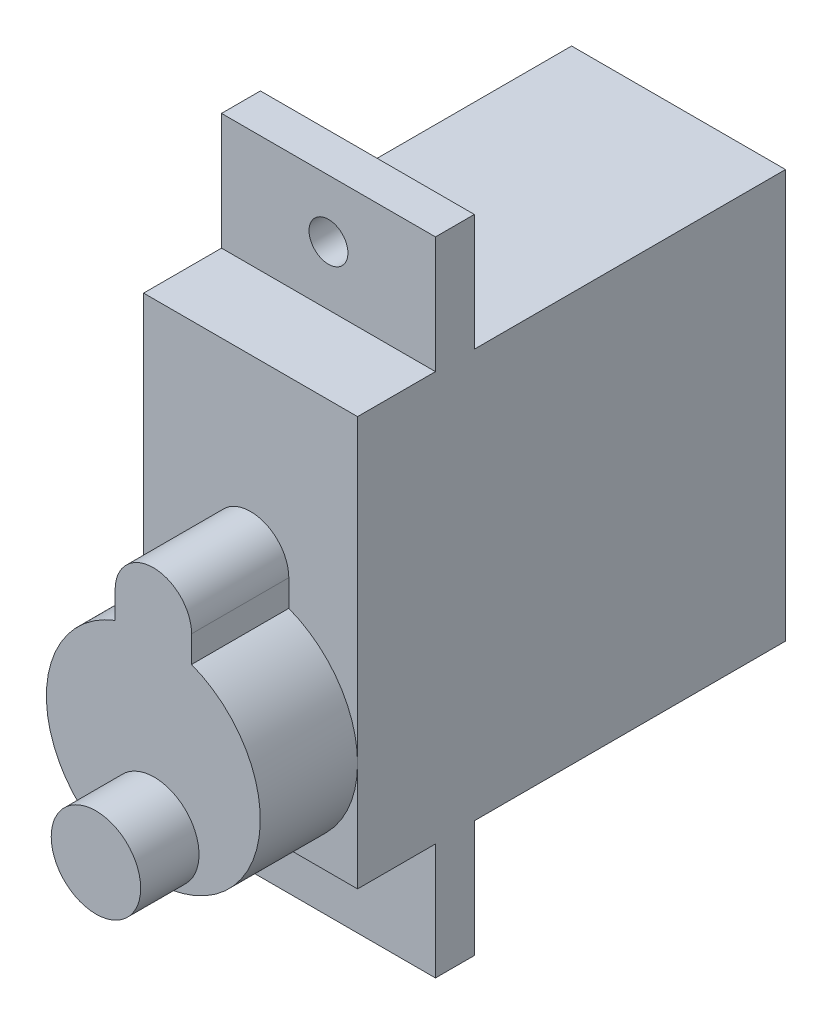
ISO-10303-21;
HEADER;
FILE_DESCRIPTION(('STEP AP214'),'2;1');
FILE_NAME('part.step','',(''),(''),'','','');
FILE_SCHEMA(('AUTOMOTIVE_DESIGN { 1 0 10303 214 1 1 1 1 }'));
ENDSEC;
DATA;
#1=APPLICATION_CONTEXT('core data for automotive mechanical design processes');
#2=APPLICATION_PROTOCOL_DEFINITION('international standard','automotive_design',2000,#1);
#3=PRODUCT_CONTEXT('',#1,'mechanical');
#4=PRODUCT('Part','Part','',(#3));
#5=PRODUCT_RELATED_PRODUCT_CATEGORY('part','',(#4));
#6=PRODUCT_DEFINITION_FORMATION('','',#4);
#7=PRODUCT_DEFINITION_CONTEXT('part definition',#1,'design');
#8=PRODUCT_DEFINITION('design','',#6,#7);
#9=PRODUCT_DEFINITION_SHAPE('','',#8);
#10=(LENGTH_UNIT() NAMED_UNIT(*) SI_UNIT(.MILLI.,.METRE.));
#11=(NAMED_UNIT(*) PLANE_ANGLE_UNIT() SI_UNIT($,.RADIAN.));
#12=(NAMED_UNIT(*) SI_UNIT($,.STERADIAN.) SOLID_ANGLE_UNIT());
#13=UNCERTAINTY_MEASURE_WITH_UNIT(LENGTH_MEASURE(1.E-05),#10,'distance_accuracy_value','');
#14=(GEOMETRIC_REPRESENTATION_CONTEXT(3) GLOBAL_UNCERTAINTY_ASSIGNED_CONTEXT((#13)) GLOBAL_UNIT_ASSIGNED_CONTEXT((#10,
#11,#12)) REPRESENTATION_CONTEXT('',''));
#15=CARTESIAN_POINT('',(0.,0.,0.));
#16=DIRECTION('',(0.,0.,1.));
#17=DIRECTION('',(1.,0.,0.));
#18=AXIS2_PLACEMENT_3D('',#15,#16,#17);
#19=CARTESIAN_POINT('',(-5.50100000000001,0.,23.0050610786414));
#20=DIRECTION('',(0.,0.,1.));
#21=DIRECTION('',(1.,0.,0.));
#22=AXIS2_PLACEMENT_3D('',#19,#20,#21);
#23=PLANE('',#22);
#24=CARTESIAN_POINT('',(0.,-4.94231580718279,23.0050610786414));
#25=DIRECTION('',(0.,0.,1.));
#26=DIRECTION('',(1.,0.,0.));
#27=AXIS2_PLACEMENT_3D('',#24,#25,#26);
#28=CIRCLE('',#27,5.5);
#29=CARTESIAN_POINT('',(5.5,-4.94231580718279,23.0050610786414));
#30=VERTEX_POINT('',#29);
#31=CARTESIAN_POINT('',(1.96459324859384,0.194840348471761,23.0050610786414));
#32=VERTEX_POINT('',#31);
#33=EDGE_CURVE('E210',#30,#32,#28,.T.);
#34=ORIENTED_EDGE('',*,*,#33,.F.);
#35=DIRECTION('',(0.,-1.,0.));
#36=VECTOR('',#35,1.);
#37=CARTESIAN_POINT('',(5.5,0.,23.0050610786414));
#38=LINE('',#37,#36);
#39=CARTESIAN_POINT('',(5.5,10.5,23.0050610786414));
#40=VERTEX_POINT('',#39);
#41=EDGE_CURVE('E287',#40,#30,#38,.T.);
#42=ORIENTED_EDGE('',*,*,#41,.F.);
#43=DIRECTION('',(1.,0.,0.));
#44=VECTOR('',#43,1.);
#45=CARTESIAN_POINT('',(-5.50100000000001,10.5,23.0050610786414));
#46=LINE('',#45,#44);
#47=CARTESIAN_POINT('',(-5.5,10.5,23.0050610786414));
#48=VERTEX_POINT('',#47);
#49=EDGE_CURVE('E276',#48,#40,#46,.T.);
#50=ORIENTED_EDGE('',*,*,#49,.F.);
#51=DIRECTION('',(0.,1.,0.));
#52=VECTOR('',#51,1.);
#53=CARTESIAN_POINT('',(-5.5,0.,23.0050610786414));
#54=LINE('',#53,#52);
#55=CARTESIAN_POINT('',(-5.5,-4.9423158071828,23.0050610786414));
#56=VERTEX_POINT('',#55);
#57=EDGE_CURVE('E306',#56,#48,#54,.T.);
#58=ORIENTED_EDGE('',*,*,#57,.F.);
#59=CARTESIAN_POINT('',(-1.96459324859384,0.19484034847176,23.0050610786414));
#60=VERTEX_POINT('',#59);
#61=EDGE_CURVE('E214',#60,#56,#28,.T.);
#62=ORIENTED_EDGE('',*,*,#61,.F.);
#63=DIRECTION('',(0.,-1.,0.));
#64=VECTOR('',#63,1.);
#65=CARTESIAN_POINT('',(-1.96459324859384,1.55992255651431,23.0050610786414));
#66=LINE('',#65,#64);
#67=CARTESIAN_POINT('',(-1.96459324859384,1.55992255651431,23.0050610786414));
#68=VERTEX_POINT('',#67);
#69=EDGE_CURVE('E222',#68,#60,#66,.T.);
#70=ORIENTED_EDGE('',*,*,#69,.F.);
#71=CARTESIAN_POINT('',(0.,1.55992255651431,23.0050610786414));
#72=DIRECTION('',(0.,0.,1.));
#73=DIRECTION('',(-1.,0.,0.));
#74=AXIS2_PLACEMENT_3D('',#71,#72,#73);
#75=CIRCLE('',#74,1.96459324859384);
#76=CARTESIAN_POINT('',(1.96459324859384,1.55992255651431,23.0050610786414));
#77=VERTEX_POINT('',#76);
#78=EDGE_CURVE('E226',#77,#68,#75,.T.);
#79=ORIENTED_EDGE('',*,*,#78,.F.);
#80=DIRECTION('',(0.,1.,0.));
#81=VECTOR('',#80,1.);
#82=CARTESIAN_POINT('',(1.96459324859384,1.55992255651431,23.0050610786414));
#83=LINE('',#82,#81);
#84=EDGE_CURVE('E58',#32,#77,#83,.T.);
#85=ORIENTED_EDGE('',*,*,#84,.F.);
#86=EDGE_LOOP('',(#34,#42,#50,#58,#62,#70,#79,#85));
#87=FACE_BOUND('',#86,.T.);
#88=ADVANCED_FACE('F36',(#87),#23,.T.);
#89=CARTESIAN_POINT('',(5.5,16.5,33.));
#90=DIRECTION('',(-1.,0.,0.));
#91=DIRECTION('',(0.,-1.,0.));
#92=AXIS2_PLACEMENT_3D('',#89,#90,#91);
#93=PLANE('',#92);
#94=DIRECTION('',(0.,0.,1.));
#95=VECTOR('',#94,1.);
#96=CARTESIAN_POINT('',(5.5,-10.5,17.));
#97=LINE('',#96,#95);
#98=CARTESIAN_POINT('',(5.5,-10.5,1.));
#99=VERTEX_POINT('',#98);
#100=CARTESIAN_POINT('',(5.5,-10.5,17.));
#101=VERTEX_POINT('',#100);
#102=EDGE_CURVE('E165',#99,#101,#97,.T.);
#103=ORIENTED_EDGE('',*,*,#102,.F.);
#104=DIRECTION('',(0.,-1.,0.));
#105=VECTOR('',#104,1.);
#106=CARTESIAN_POINT('',(5.5,-10.5,1.));
#107=LINE('',#106,#105);
#108=CARTESIAN_POINT('',(5.5,10.5,1.));
#109=VERTEX_POINT('',#108);
#110=EDGE_CURVE('E153',#109,#99,#107,.T.);
#111=ORIENTED_EDGE('',*,*,#110,.F.);
#112=DIRECTION('',(0.,0.,1.));
#113=VECTOR('',#112,1.);
#114=CARTESIAN_POINT('',(5.5,10.5,17.));
#115=LINE('',#114,#113);
#116=CARTESIAN_POINT('',(5.5,10.5,17.));
#117=VERTEX_POINT('',#116);
#118=EDGE_CURVE('E162',#109,#117,#115,.T.);
#119=ORIENTED_EDGE('',*,*,#118,.T.);
#120=DIRECTION('',(0.,1.,0.));
#121=VECTOR('',#120,1.);
#122=CARTESIAN_POINT('',(5.5,10.5,17.));
#123=LINE('',#122,#121);
#124=CARTESIAN_POINT('',(5.5,16.5,17.));
#125=VERTEX_POINT('',#124);
#126=EDGE_CURVE('E174',#117,#125,#123,.T.);
#127=ORIENTED_EDGE('',*,*,#126,.T.);
#128=DIRECTION('',(0.,0.,-1.));
#129=VECTOR('',#128,1.);
#130=CARTESIAN_POINT('',(5.5,16.5,33.));
#131=LINE('',#130,#129);
#132=CARTESIAN_POINT('',(5.5,16.5,19.));
#133=VERTEX_POINT('',#132);
#134=EDGE_CURVE('E207',#133,#125,#131,.T.);
#135=ORIENTED_EDGE('',*,*,#134,.F.);
#136=DIRECTION('',(0.,-1.,0.));
#137=VECTOR('',#136,1.);
#138=CARTESIAN_POINT('',(5.5,0.,19.));
#139=LINE('',#138,#137);
#140=CARTESIAN_POINT('',(5.5,10.5,19.));
#141=VERTEX_POINT('',#140);
#142=EDGE_CURVE('E271',#133,#141,#139,.T.);
#143=ORIENTED_EDGE('',*,*,#142,.T.);
#144=DIRECTION('',(0.,0.,1.));
#145=VECTOR('',#144,1.);
#146=CARTESIAN_POINT('',(5.5,10.5,0.));
#147=LINE('',#146,#145);
#148=EDGE_CURVE('E284',#141,#40,#147,.T.);
#149=ORIENTED_EDGE('',*,*,#148,.T.);
#150=ORIENTED_EDGE('',*,*,#41,.T.);
#151=CARTESIAN_POINT('',(5.5,-10.5309205573809,23.0050610786414));
#152=VERTEX_POINT('',#151);
#153=EDGE_CURVE('E290',#30,#152,#38,.T.);
#154=ORIENTED_EDGE('',*,*,#153,.T.);
#155=DIRECTION('',(0.,0.,1.));
#156=VECTOR('',#155,1.);
#157=CARTESIAN_POINT('',(5.5,-10.5309205573809,0.));
#158=LINE('',#157,#156);
#159=CARTESIAN_POINT('',(5.5,-10.5309205573809,19.));
#160=VERTEX_POINT('',#159);
#161=EDGE_CURVE('E291',#160,#152,#158,.T.);
#162=ORIENTED_EDGE('',*,*,#161,.F.);
#163=DIRECTION('',(0.,1.,0.));
#164=VECTOR('',#163,1.);
#165=CARTESIAN_POINT('',(5.5,0.,19.));
#166=LINE('',#165,#164);
#167=CARTESIAN_POINT('',(5.5,-16.5,19.));
#168=VERTEX_POINT('',#167);
#169=EDGE_CURVE('E294',#168,#160,#166,.T.);
#170=ORIENTED_EDGE('',*,*,#169,.F.);
#171=DIRECTION('',(0.,0.,-1.));
#172=VECTOR('',#171,1.);
#173=CARTESIAN_POINT('',(5.5,-16.5,33.));
#174=LINE('',#173,#172);
#175=CARTESIAN_POINT('',(5.5,-16.5,17.));
#176=VERTEX_POINT('',#175);
#177=EDGE_CURVE('E199',#168,#176,#174,.T.);
#178=ORIENTED_EDGE('',*,*,#177,.T.);
#179=DIRECTION('',(0.,-1.,0.));
#180=VECTOR('',#179,1.);
#181=CARTESIAN_POINT('',(5.5,-10.5,17.));
#182=LINE('',#181,#180);
#183=EDGE_CURVE('E193',#101,#176,#182,.T.);
#184=ORIENTED_EDGE('',*,*,#183,.F.);
#185=EDGE_LOOP('',(#103,#111,#119,#127,#135,#143,#149,#150,#154,#162,#170,#178,#184));
#186=FACE_BOUND('',#185,.T.);
#187=ADVANCED_FACE('F38',(#186),#93,.F.);
#188=CARTESIAN_POINT('',(-5.5,16.5,33.));
#189=DIRECTION('',(0.,-1.,0.));
#190=DIRECTION('',(0.,0.,-1.));
#191=AXIS2_PLACEMENT_3D('',#188,#189,#190);
#192=PLANE('',#191);
#193=DIRECTION('',(1.,0.,0.));
#194=VECTOR('',#193,1.);
#195=CARTESIAN_POINT('',(-5.50100000000001,16.5,19.));
#196=LINE('',#195,#194);
#197=CARTESIAN_POINT('',(-5.5,16.5,19.));
#198=VERTEX_POINT('',#197);
#199=EDGE_CURVE('E267',#198,#133,#196,.T.);
#200=ORIENTED_EDGE('',*,*,#199,.T.);
#201=ORIENTED_EDGE('',*,*,#134,.T.);
#202=DIRECTION('',(-1.,0.,0.));
#203=VECTOR('',#202,1.);
#204=CARTESIAN_POINT('',(-5.5,16.5,17.));
#205=LINE('',#204,#203);
#206=CARTESIAN_POINT('',(-5.5,16.5,17.));
#207=VERTEX_POINT('',#206);
#208=EDGE_CURVE('E180',#125,#207,#205,.T.);
#209=ORIENTED_EDGE('',*,*,#208,.T.);
#210=DIRECTION('',(0.,0.,-1.));
#211=VECTOR('',#210,1.);
#212=CARTESIAN_POINT('',(-5.5,16.5,33.));
#213=LINE('',#212,#211);
#214=EDGE_CURVE('E205',#198,#207,#213,.T.);
#215=ORIENTED_EDGE('',*,*,#214,.F.);
#216=EDGE_LOOP('',(#200,#201,#209,#215));
#217=FACE_BOUND('',#216,.T.);
#218=ADVANCED_FACE('F345',(#217),#192,.F.);
#219=CARTESIAN_POINT('',(-5.5,16.5,33.));
#220=DIRECTION('',(1.,0.,0.));
#221=DIRECTION('',(0.,1.,0.));
#222=AXIS2_PLACEMENT_3D('',#219,#220,#221);
#223=PLANE('',#222);
#224=DIRECTION('',(0.,0.,-1.));
#225=VECTOR('',#224,1.);
#226=CARTESIAN_POINT('',(-5.5,10.5,17.));
#227=LINE('',#226,#225);
#228=CARTESIAN_POINT('',(-5.5,10.5,17.));
#229=VERTEX_POINT('',#228);
#230=CARTESIAN_POINT('',(-5.5,10.5,1.));
#231=VERTEX_POINT('',#230);
#232=EDGE_CURVE('E176',#229,#231,#227,.T.);
#233=ORIENTED_EDGE('',*,*,#232,.T.);
#234=DIRECTION('',(0.,-1.,0.));
#235=VECTOR('',#234,1.);
#236=CARTESIAN_POINT('',(-5.5,16.5,1.));
#237=LINE('',#236,#235);
#238=CARTESIAN_POINT('',(-5.5,-10.5,1.));
#239=VERTEX_POINT('',#238);
#240=EDGE_CURVE('E51',#231,#239,#237,.T.);
#241=ORIENTED_EDGE('',*,*,#240,.T.);
#242=DIRECTION('',(0.,0.,-1.));
#243=VECTOR('',#242,1.);
#244=CARTESIAN_POINT('',(-5.5,-10.5,17.));
#245=LINE('',#244,#243);
#246=CARTESIAN_POINT('',(-5.5,-10.5,17.));
#247=VERTEX_POINT('',#246);
#248=EDGE_CURVE('E186',#247,#239,#245,.T.);
#249=ORIENTED_EDGE('',*,*,#248,.F.);
#250=DIRECTION('',(0.,-1.,0.));
#251=VECTOR('',#250,1.);
#252=CARTESIAN_POINT('',(-5.5,-10.5,17.));
#253=LINE('',#252,#251);
#254=CARTESIAN_POINT('',(-5.5,-16.5,17.));
#255=VERTEX_POINT('',#254);
#256=EDGE_CURVE('E196',#247,#255,#253,.T.);
#257=ORIENTED_EDGE('',*,*,#256,.T.);
#258=DIRECTION('',(0.,0.,-1.));
#259=VECTOR('',#258,1.);
#260=CARTESIAN_POINT('',(-5.5,-16.5,33.));
#261=LINE('',#260,#259);
#262=CARTESIAN_POINT('',(-5.5,-16.5,19.));
#263=VERTEX_POINT('',#262);
#264=EDGE_CURVE('E203',#263,#255,#261,.T.);
#265=ORIENTED_EDGE('',*,*,#264,.F.);
#266=DIRECTION('',(0.,-1.,0.));
#267=VECTOR('',#266,1.);
#268=CARTESIAN_POINT('',(-5.5,0.,19.));
#269=LINE('',#268,#267);
#270=CARTESIAN_POINT('',(-5.5,-10.5309205573809,19.));
#271=VERTEX_POINT('',#270);
#272=EDGE_CURVE('E183',#271,#263,#269,.T.);
#273=ORIENTED_EDGE('',*,*,#272,.F.);
#274=DIRECTION('',(0.,0.,-1.));
#275=VECTOR('',#274,1.);
#276=CARTESIAN_POINT('',(-5.5,-10.5309205573809,0.));
#277=LINE('',#276,#275);
#278=CARTESIAN_POINT('',(-5.5,-10.5309205573809,23.0050610786414));
#279=VERTEX_POINT('',#278);
#280=EDGE_CURVE('E307',#279,#271,#277,.T.);
#281=ORIENTED_EDGE('',*,*,#280,.F.);
#282=EDGE_CURVE('E303',#279,#56,#54,.T.);
#283=ORIENTED_EDGE('',*,*,#282,.T.);
#284=ORIENTED_EDGE('',*,*,#57,.T.);
#285=DIRECTION('',(0.,0.,-1.));
#286=VECTOR('',#285,1.);
#287=CARTESIAN_POINT('',(-5.5,10.5,0.));
#288=LINE('',#287,#286);
#289=CARTESIAN_POINT('',(-5.5,10.5,19.));
#290=VERTEX_POINT('',#289);
#291=EDGE_CURVE('E300',#48,#290,#288,.T.);
#292=ORIENTED_EDGE('',*,*,#291,.T.);
#293=DIRECTION('',(0.,1.,0.));
#294=VECTOR('',#293,1.);
#295=CARTESIAN_POINT('',(-5.5,0.,19.));
#296=LINE('',#295,#294);
#297=EDGE_CURVE('E297',#290,#198,#296,.T.);
#298=ORIENTED_EDGE('',*,*,#297,.T.);
#299=ORIENTED_EDGE('',*,*,#214,.T.);
#300=DIRECTION('',(0.,1.,0.));
#301=VECTOR('',#300,1.);
#302=CARTESIAN_POINT('',(-5.5,10.5,17.));
#303=LINE('',#302,#301);
#304=EDGE_CURVE('E171',#229,#207,#303,.T.);
#305=ORIENTED_EDGE('',*,*,#304,.F.);
#306=EDGE_LOOP('',(#233,#241,#249,#257,#265,#273,#281,#283,#284,#292,#298,#299,#305));
#307=FACE_BOUND('',#306,.T.);
#308=ADVANCED_FACE('F263',(#307),#223,.F.);
#309=CARTESIAN_POINT('',(-5.5,-16.5,33.));
#310=DIRECTION('',(0.,1.,0.));
#311=DIRECTION('',(0.,0.,1.));
#312=AXIS2_PLACEMENT_3D('',#309,#310,#311);
#313=PLANE('',#312);
#314=ORIENTED_EDGE('',*,*,#177,.F.);
#315=DIRECTION('',(1.,0.,0.));
#316=VECTOR('',#315,1.);
#317=CARTESIAN_POINT('',(-5.501,-16.5,19.));
#318=LINE('',#317,#316);
#319=EDGE_CURVE('E268',#263,#168,#318,.T.);
#320=ORIENTED_EDGE('',*,*,#319,.F.);
#321=ORIENTED_EDGE('',*,*,#264,.T.);
#322=DIRECTION('',(-1.,0.,0.));
#323=VECTOR('',#322,1.);
#324=CARTESIAN_POINT('',(-5.5,-16.5,17.));
#325=LINE('',#324,#323);
#326=EDGE_CURVE('E184',#176,#255,#325,.T.);
#327=ORIENTED_EDGE('',*,*,#326,.F.);
#328=EDGE_LOOP('',(#314,#320,#321,#327));
#329=FACE_BOUND('',#328,.T.);
#330=ADVANCED_FACE('F395',(#329),#313,.F.);
#331=CARTESIAN_POINT('',(-5.5,-10.5,17.));
#332=DIRECTION('',(0.,0.,1.));
#333=DIRECTION('',(1.,0.,0.));
#334=AXIS2_PLACEMENT_3D('',#331,#332,#333);
#335=PLANE('',#334);
#336=CARTESIAN_POINT('',(0.,-13.5309205573809,17.));
#337=DIRECTION('',(0.,0.,1.));
#338=DIRECTION('',(1.,0.,0.));
#339=AXIS2_PLACEMENT_3D('',#336,#337,#338);
#340=CIRCLE('',#339,1.);
#341=CARTESIAN_POINT('',(1.,-13.5309205573809,17.));
#342=VERTEX_POINT('',#341);
#343=EDGE_CURVE('E248',#342,#342,#340,.T.);
#344=ORIENTED_EDGE('',*,*,#343,.T.);
#345=EDGE_LOOP('',(#344));
#346=FACE_BOUND('',#345,.T.);
#347=ORIENTED_EDGE('',*,*,#326,.T.);
#348=ORIENTED_EDGE('',*,*,#256,.F.);
#349=DIRECTION('',(-1.,0.,0.));
#350=VECTOR('',#349,1.);
#351=CARTESIAN_POINT('',(-5.5,-10.5,17.));
#352=LINE('',#351,#350);
#353=EDGE_CURVE('E190',#101,#247,#352,.T.);
#354=ORIENTED_EDGE('',*,*,#353,.F.);
#355=ORIENTED_EDGE('',*,*,#183,.T.);
#356=EDGE_LOOP('',(#347,#348,#354,#355));
#357=FACE_BOUND('',#356,.T.);
#358=ADVANCED_FACE('F388',(#346,#357),#335,.F.);
#359=CARTESIAN_POINT('',(0.,-10.5,0.));
#360=DIRECTION('',(0.,1.,0.));
#361=DIRECTION('',(0.,0.,1.));
#362=AXIS2_PLACEMENT_3D('',#359,#360,#361);
#363=PLANE('',#362);
#364=ORIENTED_EDGE('',*,*,#248,.T.);
#365=DIRECTION('',(1.,0.,0.));
#366=VECTOR('',#365,1.);
#367=CARTESIAN_POINT('',(-14.5,-10.5,1.));
#368=LINE('',#367,#366);
#369=EDGE_CURVE('E166',#239,#99,#368,.T.);
#370=ORIENTED_EDGE('',*,*,#369,.T.);
#371=ORIENTED_EDGE('',*,*,#102,.T.);
#372=ORIENTED_EDGE('',*,*,#353,.T.);
#373=EDGE_LOOP('',(#364,#370,#371,#372));
#374=FACE_BOUND('',#373,.T.);
#375=ADVANCED_FACE('F259',(#374),#363,.F.);
#376=CARTESIAN_POINT('',(-5.5,10.5,17.));
#377=DIRECTION('',(0.,0.,-1.));
#378=DIRECTION('',(-1.,0.,0.));
#379=AXIS2_PLACEMENT_3D('',#376,#377,#378);
#380=PLANE('',#379);
#381=CARTESIAN_POINT('',(0.,13.5309205573809,17.));
#382=DIRECTION('',(0.,0.,-1.));
#383=DIRECTION('',(-1.,0.,0.));
#384=AXIS2_PLACEMENT_3D('',#381,#382,#383);
#385=CIRCLE('',#384,1.);
#386=CARTESIAN_POINT('',(-1.,13.5309205573809,17.));
#387=VERTEX_POINT('',#386);
#388=EDGE_CURVE('E245',#387,#387,#385,.T.);
#389=ORIENTED_EDGE('',*,*,#388,.F.);
#390=EDGE_LOOP('',(#389));
#391=FACE_BOUND('',#390,.T.);
#392=ORIENTED_EDGE('',*,*,#208,.F.);
#393=ORIENTED_EDGE('',*,*,#126,.F.);
#394=DIRECTION('',(-1.,0.,0.));
#395=VECTOR('',#394,1.);
#396=CARTESIAN_POINT('',(-5.5,10.5,17.));
#397=LINE('',#396,#395);
#398=EDGE_CURVE('E170',#117,#229,#397,.T.);
#399=ORIENTED_EDGE('',*,*,#398,.T.);
#400=ORIENTED_EDGE('',*,*,#304,.T.);
#401=EDGE_LOOP('',(#392,#393,#399,#400));
#402=FACE_BOUND('',#401,.T.);
#403=ADVANCED_FACE('F379',(#391,#402),#380,.T.);
#404=CARTESIAN_POINT('',(0.,10.5,0.));
#405=DIRECTION('',(0.,-1.,0.));
#406=DIRECTION('',(0.,0.,1.));
#407=AXIS2_PLACEMENT_3D('',#404,#405,#406);
#408=PLANE('',#407);
#409=ORIENTED_EDGE('',*,*,#118,.F.);
#410=DIRECTION('',(-1.,0.,0.));
#411=VECTOR('',#410,1.);
#412=CARTESIAN_POINT('',(0.,10.5,1.));
#413=LINE('',#412,#411);
#414=EDGE_CURVE('E11',#109,#231,#413,.T.);
#415=ORIENTED_EDGE('',*,*,#414,.T.);
#416=ORIENTED_EDGE('',*,*,#232,.F.);
#417=ORIENTED_EDGE('',*,*,#398,.F.);
#418=EDGE_LOOP('',(#409,#415,#416,#417));
#419=FACE_BOUND('',#418,.T.);
#420=ADVANCED_FACE('F169',(#419),#408,.F.);
#421=CARTESIAN_POINT('',(-5.50100000000001,0.,19.));
#422=DIRECTION('',(0.,0.,1.));
#423=DIRECTION('',(0.,-1.,0.));
#424=AXIS2_PLACEMENT_3D('',#421,#422,#423);
#425=PLANE('',#424);
#426=CARTESIAN_POINT('',(0.,13.5309205573809,19.));
#427=DIRECTION('',(0.,0.,1.));
#428=DIRECTION('',(-1.,0.,0.));
#429=AXIS2_PLACEMENT_3D('',#426,#427,#428);
#430=CIRCLE('',#429,1.);
#431=CARTESIAN_POINT('',(-1.,13.5309205573809,19.));
#432=VERTEX_POINT('',#431);
#433=EDGE_CURVE('E252',#432,#432,#430,.T.);
#434=ORIENTED_EDGE('',*,*,#433,.F.);
#435=EDGE_LOOP('',(#434));
#436=FACE_BOUND('',#435,.T.);
#437=DIRECTION('',(1.,0.,0.));
#438=VECTOR('',#437,1.);
#439=CARTESIAN_POINT('',(-5.50100000000001,10.5,19.));
#440=LINE('',#439,#438);
#441=EDGE_CURVE('E278',#290,#141,#440,.T.);
#442=ORIENTED_EDGE('',*,*,#441,.T.);
#443=ORIENTED_EDGE('',*,*,#142,.F.);
#444=ORIENTED_EDGE('',*,*,#199,.F.);
#445=ORIENTED_EDGE('',*,*,#297,.F.);
#446=EDGE_LOOP('',(#442,#443,#444,#445));
#447=FACE_BOUND('',#446,.T.);
#448=ADVANCED_FACE('F357',(#436,#447),#425,.T.);
#449=CARTESIAN_POINT('',(-5.50100000000001,10.5,0.));
#450=DIRECTION('',(0.,1.,0.));
#451=DIRECTION('',(-1.,0.,0.));
#452=AXIS2_PLACEMENT_3D('',#449,#450,#451);
#453=PLANE('',#452);
#454=ORIENTED_EDGE('',*,*,#49,.T.);
#455=ORIENTED_EDGE('',*,*,#148,.F.);
#456=ORIENTED_EDGE('',*,*,#441,.F.);
#457=ORIENTED_EDGE('',*,*,#291,.F.);
#458=EDGE_LOOP('',(#454,#455,#456,#457));
#459=FACE_BOUND('',#458,.T.);
#460=ADVANCED_FACE('F350',(#459),#453,.T.);
#461=EDGE_CURVE('E208',#56,#30,#28,.T.);
#462=ORIENTED_EDGE('',*,*,#461,.F.);
#463=ORIENTED_EDGE('',*,*,#282,.F.);
#464=DIRECTION('',(1.,0.,0.));
#465=VECTOR('',#464,1.);
#466=CARTESIAN_POINT('',(-5.501,-10.5309205573809,23.0050610786414));
#467=LINE('',#466,#465);
#468=EDGE_CURVE('E273',#279,#152,#467,.T.);
#469=ORIENTED_EDGE('',*,*,#468,.T.);
#470=ORIENTED_EDGE('',*,*,#153,.F.);
#471=EDGE_LOOP('',(#462,#463,#469,#470));
#472=FACE_BOUND('',#471,.T.);
#473=ADVANCED_FACE('F341',(#472),#23,.T.);
#474=CARTESIAN_POINT('',(-5.501,-10.5309205573809,0.));
#475=DIRECTION('',(0.,1.,0.));
#476=DIRECTION('',(-1.,0.,0.));
#477=AXIS2_PLACEMENT_3D('',#474,#475,#476);
#478=PLANE('',#477);
#479=ORIENTED_EDGE('',*,*,#280,.T.);
#480=DIRECTION('',(1.,0.,0.));
#481=VECTOR('',#480,1.);
#482=CARTESIAN_POINT('',(-5.501,-10.5309205573809,19.));
#483=LINE('',#482,#481);
#484=EDGE_CURVE('E270',#271,#160,#483,.T.);
#485=ORIENTED_EDGE('',*,*,#484,.T.);
#486=ORIENTED_EDGE('',*,*,#161,.T.);
#487=ORIENTED_EDGE('',*,*,#468,.F.);
#488=EDGE_LOOP('',(#479,#485,#486,#487));
#489=FACE_BOUND('',#488,.T.);
#490=ADVANCED_FACE('F349',(#489),#478,.F.);
#491=CARTESIAN_POINT('',(-5.50100000000001,0.,19.));
#492=DIRECTION('',(0.,0.,-1.));
#493=DIRECTION('',(-1.,0.,0.));
#494=AXIS2_PLACEMENT_3D('',#491,#492,#493);
#495=PLANE('',#494);
#496=CARTESIAN_POINT('',(0.,-13.5309205573809,19.));
#497=DIRECTION('',(0.,0.,1.));
#498=DIRECTION('',(1.,0.,0.));
#499=AXIS2_PLACEMENT_3D('',#496,#497,#498);
#500=CIRCLE('',#499,1.);
#501=CARTESIAN_POINT('',(1.,-13.5309205573809,19.));
#502=VERTEX_POINT('',#501);
#503=EDGE_CURVE('E251',#502,#502,#500,.T.);
#504=ORIENTED_EDGE('',*,*,#503,.F.);
#505=EDGE_LOOP('',(#504));
#506=FACE_BOUND('',#505,.T.);
#507=ORIENTED_EDGE('',*,*,#272,.T.);
#508=ORIENTED_EDGE('',*,*,#319,.T.);
#509=ORIENTED_EDGE('',*,*,#169,.T.);
#510=ORIENTED_EDGE('',*,*,#484,.F.);
#511=EDGE_LOOP('',(#507,#508,#509,#510));
#512=FACE_BOUND('',#511,.T.);
#513=ADVANCED_FACE('F337',(#506,#512),#495,.F.);
#514=CARTESIAN_POINT('',(0.,1.55992255651431,28.0050610786414));
#515=DIRECTION('',(0.,0.,-1.));
#516=DIRECTION('',(-1.,0.,0.));
#517=AXIS2_PLACEMENT_3D('',#514,#515,#516);
#518=CYLINDRICAL_SURFACE('',#517,1.96459324859384);
#519=ORIENTED_EDGE('',*,*,#78,.T.);
#520=DIRECTION('',(0.,0.,-1.));
#521=VECTOR('',#520,1.);
#522=CARTESIAN_POINT('',(-1.96459324859384,1.55992255651431,28.0050610786414));
#523=LINE('',#522,#521);
#524=CARTESIAN_POINT('',(-1.96459324859384,1.55992255651431,28.0050610786414));
#525=VERTEX_POINT('',#524);
#526=EDGE_CURVE('E310',#525,#68,#523,.T.);
#527=ORIENTED_EDGE('',*,*,#526,.F.);
#528=CARTESIAN_POINT('',(0.,1.55992255651431,28.0050610786414));
#529=DIRECTION('',(0.,0.,1.));
#530=DIRECTION('',(-1.,0.,0.));
#531=AXIS2_PLACEMENT_3D('',#528,#529,#530);
#532=CIRCLE('',#531,1.96459324859384);
#533=CARTESIAN_POINT('',(1.96459324859384,1.55992255651431,28.0050610786414));
#534=VERTEX_POINT('',#533);
#535=EDGE_CURVE('E224',#534,#525,#532,.T.);
#536=ORIENTED_EDGE('',*,*,#535,.F.);
#537=DIRECTION('',(0.,0.,-1.));
#538=VECTOR('',#537,1.);
#539=CARTESIAN_POINT('',(1.96459324859384,1.55992255651431,28.0050610786414));
#540=LINE('',#539,#538);
#541=EDGE_CURVE('E236',#534,#77,#540,.T.);
#542=ORIENTED_EDGE('',*,*,#541,.T.);
#543=EDGE_LOOP('',(#519,#527,#536,#542));
#544=FACE_BOUND('',#543,.T.);
#545=ADVANCED_FACE('F320',(#544),#518,.T.);
#546=CARTESIAN_POINT('',(-1.96459324859384,1.55992255651431,28.0050610786414));
#547=DIRECTION('',(1.,0.,0.));
#548=DIRECTION('',(0.,1.,0.));
#549=AXIS2_PLACEMENT_3D('',#546,#547,#548);
#550=PLANE('',#549);
#551=ORIENTED_EDGE('',*,*,#69,.T.);
#552=DIRECTION('',(0.,0.,-1.));
#553=VECTOR('',#552,1.);
#554=CARTESIAN_POINT('',(-1.96459324859384,0.19484034847176,28.0050610786414));
#555=LINE('',#554,#553);
#556=CARTESIAN_POINT('',(-1.96459324859384,0.19484034847176,28.0050610786414));
#557=VERTEX_POINT('',#556);
#558=EDGE_CURVE('E312',#557,#60,#555,.T.);
#559=ORIENTED_EDGE('',*,*,#558,.F.);
#560=DIRECTION('',(0.,-1.,0.));
#561=VECTOR('',#560,1.);
#562=CARTESIAN_POINT('',(-1.96459324859384,1.55992255651431,28.0050610786414));
#563=LINE('',#562,#561);
#564=EDGE_CURVE('E239',#525,#557,#563,.T.);
#565=ORIENTED_EDGE('',*,*,#564,.F.);
#566=ORIENTED_EDGE('',*,*,#526,.T.);
#567=EDGE_LOOP('',(#551,#559,#565,#566));
#568=FACE_BOUND('',#567,.T.);
#569=ADVANCED_FACE('F329',(#568),#550,.F.);
#570=CARTESIAN_POINT('',(0.,-4.94231580718279,28.0050610786414));
#571=DIRECTION('',(0.,0.,-1.));
#572=DIRECTION('',(-1.,0.,0.));
#573=AXIS2_PLACEMENT_3D('',#570,#571,#572);
#574=CYLINDRICAL_SURFACE('',#573,5.5);
#575=ORIENTED_EDGE('',*,*,#61,.T.);
#576=ORIENTED_EDGE('',*,*,#461,.T.);
#577=ORIENTED_EDGE('',*,*,#33,.T.);
#578=DIRECTION('',(0.,0.,-1.));
#579=VECTOR('',#578,1.);
#580=CARTESIAN_POINT('',(1.96459324859384,0.194840348471761,28.0050610786414));
#581=LINE('',#580,#579);
#582=CARTESIAN_POINT('',(1.96459324859384,0.194840348471761,28.0050610786414));
#583=VERTEX_POINT('',#582);
#584=EDGE_CURVE('E314',#583,#32,#581,.T.);
#585=ORIENTED_EDGE('',*,*,#584,.F.);
#586=CARTESIAN_POINT('',(0.,-4.94231580718279,28.0050610786414));
#587=DIRECTION('',(0.,0.,1.));
#588=DIRECTION('',(1.,0.,0.));
#589=AXIS2_PLACEMENT_3D('',#586,#587,#588);
#590=CIRCLE('',#589,5.5);
#591=EDGE_CURVE('E237',#557,#583,#590,.T.);
#592=ORIENTED_EDGE('',*,*,#591,.F.);
#593=ORIENTED_EDGE('',*,*,#558,.T.);
#594=EDGE_LOOP('',(#575,#576,#577,#585,#592,#593));
#595=FACE_BOUND('',#594,.T.);
#596=ADVANCED_FACE('F326',(#595),#574,.T.);
#597=CARTESIAN_POINT('',(1.96459324859384,1.55992255651431,28.0050610786414));
#598=DIRECTION('',(-1.,0.,0.));
#599=DIRECTION('',(0.,0.,1.));
#600=AXIS2_PLACEMENT_3D('',#597,#598,#599);
#601=PLANE('',#600);
#602=ORIENTED_EDGE('',*,*,#84,.T.);
#603=ORIENTED_EDGE('',*,*,#541,.F.);
#604=DIRECTION('',(0.,1.,0.));
#605=VECTOR('',#604,1.);
#606=CARTESIAN_POINT('',(1.96459324859384,1.55992255651431,28.0050610786414));
#607=LINE('',#606,#605);
#608=EDGE_CURVE('E234',#583,#534,#607,.T.);
#609=ORIENTED_EDGE('',*,*,#608,.F.);
#610=ORIENTED_EDGE('',*,*,#584,.T.);
#611=EDGE_LOOP('',(#602,#603,#609,#610));
#612=FACE_BOUND('',#611,.T.);
#613=ADVANCED_FACE('F324',(#612),#601,.F.);
#614=CARTESIAN_POINT('',(0.,1.55992255651431,28.0050610786414));
#615=DIRECTION('',(0.,0.,-1.));
#616=DIRECTION('',(-1.,0.,0.));
#617=AXIS2_PLACEMENT_3D('',#614,#615,#616);
#618=PLANE('',#617);
#619=CARTESIAN_POINT('',(0.0484422957809254,-8.07912527412854,28.0050610786414));
#620=DIRECTION('',(0.,0.,-1.));
#621=DIRECTION('',(-1.,0.,0.));
#622=AXIS2_PLACEMENT_3D('',#619,#620,#621);
#623=CIRCLE('',#622,2.3);
#624=CARTESIAN_POINT('',(-2.25155770421907,-8.07912527412854,28.0050610786414));
#625=VERTEX_POINT('',#624);
#626=EDGE_CURVE('E44',#625,#625,#623,.F.);
#627=ORIENTED_EDGE('',*,*,#626,.F.);
#628=EDGE_LOOP('',(#627));
#629=FACE_BOUND('',#628,.T.);
#630=ORIENTED_EDGE('',*,*,#535,.T.);
#631=ORIENTED_EDGE('',*,*,#564,.T.);
#632=ORIENTED_EDGE('',*,*,#591,.T.);
#633=ORIENTED_EDGE('',*,*,#608,.T.);
#634=EDGE_LOOP('',(#630,#631,#632,#633));
#635=FACE_BOUND('',#634,.T.);
#636=ADVANCED_FACE('F328',(#629,#635),#618,.F.);
#637=CARTESIAN_POINT('',(0.0484422957809254,-8.07912527412854,31.0050610786414));
#638=DIRECTION('',(0.,0.,-1.));
#639=DIRECTION('',(-1.,0.,0.));
#640=AXIS2_PLACEMENT_3D('',#637,#638,#639);
#641=CYLINDRICAL_SURFACE('',#640,2.3);
#642=CARTESIAN_POINT('',(0.0484422957809254,-8.07912527412854,31.0050610786414));
#643=DIRECTION('',(0.,0.,1.));
#644=DIRECTION('',(1.,0.,0.));
#645=AXIS2_PLACEMENT_3D('',#642,#643,#644);
#646=CIRCLE('',#645,2.3);
#647=CARTESIAN_POINT('',(2.34844229578093,-8.07912527412854,31.0050610786414));
#648=VERTEX_POINT('',#647);
#649=EDGE_CURVE('E231',#648,#648,#646,.T.);
#650=ORIENTED_EDGE('',*,*,#649,.F.);
#651=EDGE_LOOP('',(#650));
#652=FACE_BOUND('',#651,.T.);
#653=ORIENTED_EDGE('',*,*,#626,.T.);
#654=EDGE_LOOP('',(#653));
#655=FACE_BOUND('',#654,.T.);
#656=ADVANCED_FACE('F465',(#652,#655),#641,.T.);
#657=CARTESIAN_POINT('',(0.0484422957809254,-8.07912527412854,31.0050610786414));
#658=DIRECTION('',(0.,0.,1.));
#659=DIRECTION('',(1.,0.,0.));
#660=AXIS2_PLACEMENT_3D('',#657,#658,#659);
#661=PLANE('',#660);
#662=ORIENTED_EDGE('',*,*,#649,.T.);
#663=EDGE_LOOP('',(#662));
#664=FACE_BOUND('',#663,.T.);
#665=ADVANCED_FACE('F457',(#664),#661,.T.);
#666=CARTESIAN_POINT('',(0.,-13.5309205573809,16.));
#667=DIRECTION('',(0.,0.,1.));
#668=DIRECTION('',(1.,0.,0.));
#669=AXIS2_PLACEMENT_3D('',#666,#667,#668);
#670=CYLINDRICAL_SURFACE('',#669,1.);
#671=ORIENTED_EDGE('',*,*,#503,.T.);
#672=EDGE_LOOP('',(#671));
#673=FACE_BOUND('',#672,.T.);
#674=ORIENTED_EDGE('',*,*,#343,.F.);
#675=EDGE_LOOP('',(#674));
#676=FACE_BOUND('',#675,.T.);
#677=ADVANCED_FACE('F450',(#673,#676),#670,.F.);
#678=CARTESIAN_POINT('',(0.,13.5309205573809,16.));
#679=DIRECTION('',(0.,0.,1.));
#680=DIRECTION('',(1.,0.,0.));
#681=AXIS2_PLACEMENT_3D('',#678,#679,#680);
#682=CYLINDRICAL_SURFACE('',#681,1.);
#683=ORIENTED_EDGE('',*,*,#388,.T.);
#684=EDGE_LOOP('',(#683));
#685=FACE_BOUND('',#684,.T.);
#686=ORIENTED_EDGE('',*,*,#433,.T.);
#687=EDGE_LOOP('',(#686));
#688=FACE_BOUND('',#687,.T.);
#689=ADVANCED_FACE('F440',(#685,#688),#682,.F.);
#690=CARTESIAN_POINT('',(-14.5,-10.5,1.));
#691=DIRECTION('',(0.,0.,1.));
#692=DIRECTION('',(1.,0.,0.));
#693=AXIS2_PLACEMENT_3D('',#690,#691,#692);
#694=PLANE('',#693);
#695=ORIENTED_EDGE('',*,*,#414,.F.);
#696=ORIENTED_EDGE('',*,*,#110,.T.);
#697=ORIENTED_EDGE('',*,*,#369,.F.);
#698=ORIENTED_EDGE('',*,*,#240,.F.);
#699=EDGE_LOOP('',(#695,#696,#697,#698));
#700=FACE_BOUND('',#699,.T.);
#701=ADVANCED_FACE('F152',(#700),#694,.F.);
#702=CLOSED_SHELL('',(#88,#187,#218,#308,#330,#358,#375,#403,#420,#448,#460,#473,#490,#513,#545,
#569,#596,#613,#636,#656,#665,#677,#689,#701));
#703=MANIFOLD_SOLID_BREP('B2',#702);
#704=ADVANCED_BREP_SHAPE_REPRESENTATION('',(#18,#703),#14);
#705=SHAPE_DEFINITION_REPRESENTATION(#9,#704);
ENDSEC;
END-ISO-10303-21;
